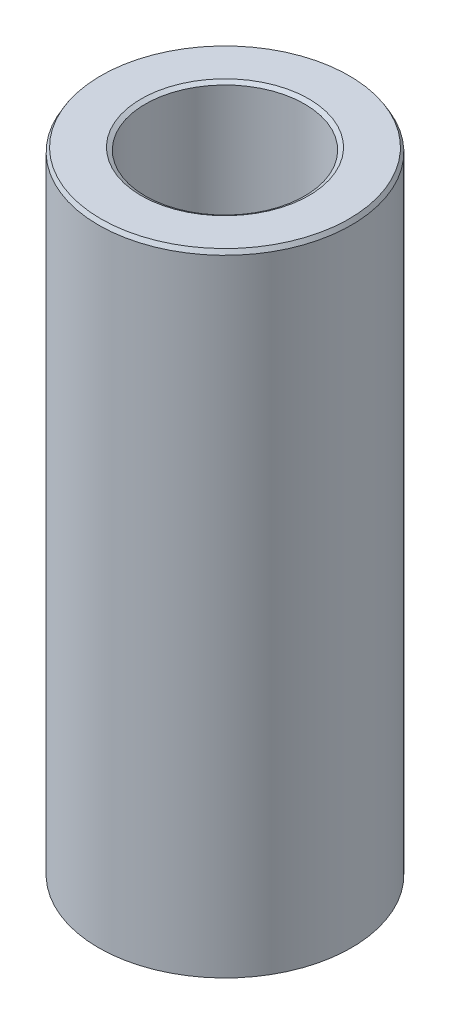
ISO-10303-21;
HEADER;
FILE_DESCRIPTION(('STEP AP214'),'2;1');
FILE_NAME('part.step','',(''),(''),'','','');
FILE_SCHEMA(('AUTOMOTIVE_DESIGN { 1 0 10303 214 1 1 1 1 }'));
ENDSEC;
DATA;
#1=APPLICATION_CONTEXT('core data for automotive mechanical design processes');
#2=APPLICATION_PROTOCOL_DEFINITION('international standard','automotive_design',2000,#1);
#3=PRODUCT_CONTEXT('',#1,'mechanical');
#4=PRODUCT('Part','Part','',(#3));
#5=PRODUCT_RELATED_PRODUCT_CATEGORY('part','',(#4));
#6=PRODUCT_DEFINITION_FORMATION('','',#4);
#7=PRODUCT_DEFINITION_CONTEXT('part definition',#1,'design');
#8=PRODUCT_DEFINITION('design','',#6,#7);
#9=PRODUCT_DEFINITION_SHAPE('','',#8);
#10=(LENGTH_UNIT() NAMED_UNIT(*) SI_UNIT(.MILLI.,.METRE.));
#11=(NAMED_UNIT(*) PLANE_ANGLE_UNIT() SI_UNIT($,.RADIAN.));
#12=(NAMED_UNIT(*) SI_UNIT($,.STERADIAN.) SOLID_ANGLE_UNIT());
#13=UNCERTAINTY_MEASURE_WITH_UNIT(LENGTH_MEASURE(1.E-05),#10,'distance_accuracy_value','');
#14=(GEOMETRIC_REPRESENTATION_CONTEXT(3) GLOBAL_UNCERTAINTY_ASSIGNED_CONTEXT((#13)) GLOBAL_UNIT_ASSIGNED_CONTEXT((#10,
#11,#12)) REPRESENTATION_CONTEXT('',''));
#15=CARTESIAN_POINT('',(0.,0.,0.));
#16=DIRECTION('',(0.,0.,1.));
#17=DIRECTION('',(1.,0.,0.));
#18=AXIS2_PLACEMENT_3D('',#15,#16,#17);
#19=CARTESIAN_POINT('',(0.,137.492743221976,0.));
#20=DIRECTION('',(0.,-1.,0.));
#21=DIRECTION('',(0.,0.,-1.));
#22=AXIS2_PLACEMENT_3D('',#19,#20,#21);
#23=CYLINDRICAL_SURFACE('',#22,27.5);
#24=CARTESIAN_POINT('',(0.,0.522147581139915,0.));
#25=DIRECTION('',(0.,1.,0.));
#26=DIRECTION('',(0.,0.,1.));
#27=AXIS2_PLACEMENT_3D('',#24,#25,#26);
#28=CIRCLE('',#27,27.5);
#29=CARTESIAN_POINT('',(0.,0.522147581139915,27.5));
#30=VERTEX_POINT('',#29);
#31=EDGE_CURVE('E10',#30,#30,#28,.T.);
#32=ORIENTED_EDGE('',*,*,#31,.T.);
#33=EDGE_LOOP('',(#32));
#34=FACE_BOUND('',#33,.T.);
#35=CARTESIAN_POINT('',(0.,136.588357082393,0.));
#36=DIRECTION('',(0.,1.,0.));
#37=DIRECTION('',(0.,0.,1.));
#38=AXIS2_PLACEMENT_3D('',#35,#36,#37);
#39=CIRCLE('',#38,27.5);
#40=CARTESIAN_POINT('',(0.,136.588357082393,27.5));
#41=VERTEX_POINT('',#40);
#42=EDGE_CURVE('E50',#41,#41,#39,.F.);
#43=ORIENTED_EDGE('',*,*,#42,.T.);
#44=EDGE_LOOP('',(#43));
#45=FACE_BOUND('',#44,.T.);
#46=ADVANCED_FACE('F39',(#34,#45),#23,.T.);
#47=CARTESIAN_POINT('',(0.,137.492743221976,0.));
#48=DIRECTION('',(0.,1.,0.));
#49=DIRECTION('',(0.,0.,1.));
#50=AXIS2_PLACEMENT_3D('',#47,#48,#49);
#51=PLANE('',#50);
#52=CARTESIAN_POINT('',(0.,137.492743221976,0.));
#53=DIRECTION('',(0.,1.,0.));
#54=DIRECTION('',(0.,0.,1.));
#55=AXIS2_PLACEMENT_3D('',#52,#53,#54);
#56=CIRCLE('',#55,18.2297252548286);
#57=CARTESIAN_POINT('',(0.,137.492743221976,18.2297252548286));
#58=VERTEX_POINT('',#57);
#59=EDGE_CURVE('E58',#58,#58,#56,.F.);
#60=ORIENTED_EDGE('',*,*,#59,.T.);
#61=EDGE_LOOP('',(#60));
#62=FACE_BOUND('',#61,.T.);
#63=CARTESIAN_POINT('',(0.,137.492743221976,0.));
#64=DIRECTION('',(0.,1.,0.));
#65=DIRECTION('',(0.,0.,1.));
#66=AXIS2_PLACEMENT_3D('',#63,#64,#65);
#67=CIRCLE('',#66,26.9778524188601);
#68=CARTESIAN_POINT('',(0.,137.492743221976,26.9778524188601));
#69=VERTEX_POINT('',#68);
#70=EDGE_CURVE('E61',#69,#69,#67,.T.);
#71=ORIENTED_EDGE('',*,*,#70,.T.);
#72=EDGE_LOOP('',(#71));
#73=FACE_BOUND('',#72,.T.);
#74=ADVANCED_FACE('F88',(#62,#73),#51,.T.);
#75=CARTESIAN_POINT('',(0.,0.,0.));
#76=DIRECTION('',(0.,1.,0.));
#77=DIRECTION('',(0.,0.,1.));
#78=AXIS2_PLACEMENT_3D('',#75,#76,#77);
#79=PLANE('',#78);
#80=CARTESIAN_POINT('',(0.,0.,0.));
#81=DIRECTION('',(0.,1.,0.));
#82=DIRECTION('',(0.,0.,1.));
#83=AXIS2_PLACEMENT_3D('',#80,#81,#82);
#84=CIRCLE('',#83,17.847486696385);
#85=CARTESIAN_POINT('',(0.,0.,-17.847486696385));
#86=VERTEX_POINT('',#85);
#87=EDGE_CURVE('E51',#86,#86,#84,.T.);
#88=ORIENTED_EDGE('',*,*,#87,.T.);
#89=EDGE_LOOP('',(#88));
#90=FACE_BOUND('',#89,.T.);
#91=CARTESIAN_POINT('',(0.,0.,0.));
#92=DIRECTION('',(0.,1.,0.));
#93=DIRECTION('',(0.,0.,1.));
#94=AXIS2_PLACEMENT_3D('',#91,#92,#93);
#95=CIRCLE('',#94,26.5956138604165);
#96=CARTESIAN_POINT('',(0.,0.,26.5956138604165));
#97=VERTEX_POINT('',#96);
#98=EDGE_CURVE('E54',#97,#97,#95,.F.);
#99=ORIENTED_EDGE('',*,*,#98,.T.);
#100=EDGE_LOOP('',(#99));
#101=FACE_BOUND('',#100,.T.);
#102=ADVANCED_FACE('F83',(#90,#101),#79,.F.);
#103=CARTESIAN_POINT('',(0.,137.492743221976,0.));
#104=DIRECTION('',(0.,-1.,0.));
#105=DIRECTION('',(0.,0.,-1.));
#106=AXIS2_PLACEMENT_3D('',#103,#104,#105);
#107=CYLINDRICAL_SURFACE('',#106,17.3253391152451);
#108=CARTESIAN_POINT('',(0.,136.970595640836,0.));
#109=DIRECTION('',(0.,1.,0.));
#110=DIRECTION('',(0.,0.,1.));
#111=AXIS2_PLACEMENT_3D('',#108,#109,#110);
#112=CIRCLE('',#111,17.3253391152451);
#113=CARTESIAN_POINT('',(0.,136.970595640836,17.3253391152451));
#114=VERTEX_POINT('',#113);
#115=EDGE_CURVE('E67',#114,#114,#112,.T.);
#116=ORIENTED_EDGE('',*,*,#115,.T.);
#117=EDGE_LOOP('',(#116));
#118=FACE_BOUND('',#117,.T.);
#119=CARTESIAN_POINT('',(0.,0.904386139583518,0.));
#120=DIRECTION('',(0.,1.,0.));
#121=DIRECTION('',(0.,0.,1.));
#122=AXIS2_PLACEMENT_3D('',#119,#120,#121);
#123=CIRCLE('',#122,17.3253391152451);
#124=CARTESIAN_POINT('',(0.,0.904386139583518,-17.3253391152451));
#125=VERTEX_POINT('',#124);
#126=EDGE_CURVE('E69',#125,#125,#123,.F.);
#127=ORIENTED_EDGE('',*,*,#126,.T.);
#128=EDGE_LOOP('',(#127));
#129=FACE_BOUND('',#128,.T.);
#130=ADVANCED_FACE('F71',(#118,#129),#107,.F.);
#131=CARTESIAN_POINT('',(0.,136.970595640836,0.));
#132=DIRECTION('',(0.,1.,0.));
#133=DIRECTION('',(0.,0.,1.));
#134=AXIS2_PLACEMENT_3D('',#131,#132,#133);
#135=CONICAL_SURFACE('',#134,17.3253391152451,1.04719755119658);
#136=ORIENTED_EDGE('',*,*,#59,.F.);
#137=EDGE_LOOP('',(#136));
#138=FACE_BOUND('',#137,.T.);
#139=ORIENTED_EDGE('',*,*,#115,.F.);
#140=EDGE_LOOP('',(#139));
#141=FACE_BOUND('',#140,.T.);
#142=ADVANCED_FACE('F77',(#138,#141),#135,.F.);
#143=CARTESIAN_POINT('',(0.,0.,0.));
#144=DIRECTION('',(0.,-1.,0.));
#145=DIRECTION('',(0.,0.,-1.));
#146=AXIS2_PLACEMENT_3D('',#143,#144,#145);
#147=CONICAL_SURFACE('',#146,17.847486696385,0.523598775598293);
#148=CARTESIAN_POINT('',(0.,0.904386139583518,-17.3253391152451));
#149=CARTESIAN_POINT('',(0.,0.894965450629523,-17.3307781525486));
#150=CARTESIAN_POINT('',(0.,0.885544761675528,-17.3362171898522));
#151=CARTESIAN_POINT('',(0.,0.866703383767538,-17.3470952644592));
#152=CARTESIAN_POINT('',(0.,0.857282694813543,-17.3525343017628));
#153=CARTESIAN_POINT('',(0.,0.838441316905553,-17.3634123763699));
#154=CARTESIAN_POINT('',(0.,0.829020627951558,-17.3688514136734));
#155=CARTESIAN_POINT('',(0.,0.810179250043568,-17.3797294882805));
#156=CARTESIAN_POINT('',(0.,0.800758561089574,-17.385168525584));
#157=CARTESIAN_POINT('',(0.,0.781917183181584,-17.3960466001911));
#158=CARTESIAN_POINT('',(0.,0.772496494227589,-17.4014856374947));
#159=CARTESIAN_POINT('',(0.,0.753655116319598,-17.4123637121017));
#160=CARTESIAN_POINT('',(0.,0.744234427365604,-17.4178027494053));
#161=CARTESIAN_POINT('',(0.,0.725393049457614,-17.4286808240124));
#162=CARTESIAN_POINT('',(0.,0.715972360503619,-17.4341198613159));
#163=CARTESIAN_POINT('',(0.,0.697130982595629,-17.444997935923));
#164=CARTESIAN_POINT('',(0.,0.687710293641634,-17.4504369732265));
#165=CARTESIAN_POINT('',(0.,0.668868915733644,-17.4613150478336));
#166=CARTESIAN_POINT('',(0.,0.659448226779648,-17.4667540851371));
#167=CARTESIAN_POINT('',(0.,0.640606848871659,-17.4776321597442));
#168=CARTESIAN_POINT('',(0.,0.631186159917664,-17.4830711970478));
#169=CARTESIAN_POINT('',(0.,0.612344782009674,-17.4939492716548));
#170=CARTESIAN_POINT('',(0.,0.602924093055679,-17.4993883089584));
#171=CARTESIAN_POINT('',(0.,0.584082715147689,-17.5102663835655));
#172=CARTESIAN_POINT('',(0.,0.574662026193694,-17.515705420869));
#173=CARTESIAN_POINT('',(0.,0.555820648285704,-17.5265834954761));
#174=CARTESIAN_POINT('',(0.,0.546399959331709,-17.5320225327796));
#175=CARTESIAN_POINT('',(0.,0.527558581423719,-17.5429006073867));
#176=CARTESIAN_POINT('',(0.,0.518137892469724,-17.5483396446902));
#177=CARTESIAN_POINT('',(0.,0.499296514561734,-17.5592177192973));
#178=CARTESIAN_POINT('',(0.,0.489875825607739,-17.5646567566009));
#179=CARTESIAN_POINT('',(0.,0.471034447699749,-17.575534831208));
#180=CARTESIAN_POINT('',(0.,0.461613758745754,-17.5809738685115));
#181=CARTESIAN_POINT('',(0.,0.442772380837764,-17.5918519431186));
#182=CARTESIAN_POINT('',(0.,0.433351691883769,-17.5972909804221));
#183=CARTESIAN_POINT('',(0.,0.414510313975779,-17.6081690550292));
#184=CARTESIAN_POINT('',(0.,0.405089625021784,-17.6136080923327));
#185=CARTESIAN_POINT('',(0.,0.386248247113794,-17.6244861669398));
#186=CARTESIAN_POINT('',(0.,0.376827558159799,-17.6299252042434));
#187=CARTESIAN_POINT('',(0.,0.357986180251809,-17.6408032788504));
#188=CARTESIAN_POINT('',(0.,0.348565491297814,-17.646242316154));
#189=CARTESIAN_POINT('',(0.,0.329724113389824,-17.6571203907611));
#190=CARTESIAN_POINT('',(0.,0.320303424435829,-17.6625594280646));
#191=CARTESIAN_POINT('',(0.,0.301462046527839,-17.6734375026717));
#192=CARTESIAN_POINT('',(0.,0.292041357573844,-17.6788765399752));
#193=CARTESIAN_POINT('',(0.,0.273199979665854,-17.6897546145823));
#194=CARTESIAN_POINT('',(0.,0.26377929071186,-17.6951936518858));
#195=CARTESIAN_POINT('',(0.,0.24493791280387,-17.7060717264929));
#196=CARTESIAN_POINT('',(0.,0.235517223849875,-17.7115107637965));
#197=CARTESIAN_POINT('',(0.,0.216675845941885,-17.7223888384036));
#198=CARTESIAN_POINT('',(0.,0.20725515698789,-17.7278278757071));
#199=CARTESIAN_POINT('',(0.,0.1884137790799,-17.7387059503142));
#200=CARTESIAN_POINT('',(0.,0.178993090125905,-17.7441449876177));
#201=CARTESIAN_POINT('',(0.,0.160151712217915,-17.7550230622248));
#202=CARTESIAN_POINT('',(0.,0.15073102326392,-17.7604620995283));
#203=CARTESIAN_POINT('',(0.,0.13188964535593,-17.7713401741354));
#204=CARTESIAN_POINT('',(0.,0.122468956401934,-17.776779211439));
#205=CARTESIAN_POINT('',(0.,0.103627578493945,-17.787657286046));
#206=CARTESIAN_POINT('',(0.,0.09420688953995,-17.7930963233496));
#207=CARTESIAN_POINT('',(0.,0.0753655116319602,-17.8039743979567));
#208=CARTESIAN_POINT('',(0.,0.065944822677965,-17.8094134352602));
#209=CARTESIAN_POINT('',(0.,0.0471034447699748,-17.8202915098673));
#210=CARTESIAN_POINT('',(0.,0.0376827558159799,-17.8257305471708));
#211=CARTESIAN_POINT('',(0.,0.01884137790799,-17.8366086217779));
#212=CARTESIAN_POINT('',(0.,0.00942068895399509,-17.8420476590814));
#213=CARTESIAN_POINT('',(0.,0.,-17.847486696385));
#214=B_SPLINE_CURVE_WITH_KNOTS('',3,(#148,#149,#150,#151,#152,#153,#154,#155,#156,#157,#158,
#159,#160,#161,#162,#163,#164,#165,#166,#167,#168,#169,#170,#171,#172,#173,#174,#175,#176,#177,
#178,#179,#180,#181,#182,#183,#184,#185,#186,#187,#188,#189,#190,#191,#192,#193,#194,#195,#196,
#197,#198,#199,#200,#201,#202,#203,#204,#205,#206,#207,#208,#209,#210,#211,#212,#213),
.UNSPECIFIED.,.F.,.F.,(4,2,2,2,2,2,2,2,2,2,2,2,2,2,2,2,2,2,2,2,2,2,2,2,2,2,2,2,2,2,2,2,4),(0.,
0.0326342238212441,0.0652684476424881,0.0979026714637322,0.130536895284978,0.163171119106222,
0.195805342927466,0.22843956674871,0.261073790569954,0.293708014391198,0.326342238212444,
0.358976462033688,0.391610685854932,0.424244909676176,0.45687913349742,0.489513357318664,
0.52214758113991,0.554781804961154,0.587416028782398,0.620050252603642,0.652684476424886,
0.68531870024613,0.717952924067374,0.75058714788862,0.783221371709864,0.815855595531108,
0.848489819352352,0.881124043173596,0.91375826699484,0.946392490816086,0.97902671463733,
1.01166093845857,1.04429516227982),.UNSPECIFIED.);
#215=EDGE_CURVE('BSEAM73',#125,#86,#214,.T.);
#216=ORIENTED_EDGE('',*,*,#126,.F.);
#217=ORIENTED_EDGE('',*,*,#87,.F.);
#218=ORIENTED_EDGE('',*,*,#215,.T.);
#219=ORIENTED_EDGE('',*,*,#215,.F.);
#220=EDGE_LOOP('',(#216,#218,#217,#219));
#221=FACE_BOUND('',#220,.T.);
#222=ADVANCED_FACE('F73',(#221),#147,.F.);
#223=CARTESIAN_POINT('',(0.,0.522147581139915,0.));
#224=DIRECTION('',(0.,1.,0.));
#225=DIRECTION('',(0.,0.,1.));
#226=AXIS2_PLACEMENT_3D('',#223,#224,#225);
#227=CONICAL_SURFACE('',#226,27.5,1.04719755119659);
#228=ORIENTED_EDGE('',*,*,#98,.F.);
#229=EDGE_LOOP('',(#228));
#230=FACE_BOUND('',#229,.T.);
#231=ORIENTED_EDGE('',*,*,#31,.F.);
#232=EDGE_LOOP('',(#231));
#233=FACE_BOUND('',#232,.T.);
#234=ADVANCED_FACE('F76',(#230,#233),#227,.T.);
#235=CARTESIAN_POINT('',(0.,137.492743221976,0.));
#236=DIRECTION('',(0.,-1.,0.));
#237=DIRECTION('',(0.,0.,-1.));
#238=AXIS2_PLACEMENT_3D('',#235,#236,#237);
#239=CONICAL_SURFACE('',#238,26.9778524188601,0.523598775598295);
#240=ORIENTED_EDGE('',*,*,#42,.F.);
#241=EDGE_LOOP('',(#240));
#242=FACE_BOUND('',#241,.T.);
#243=ORIENTED_EDGE('',*,*,#70,.F.);
#244=EDGE_LOOP('',(#243));
#245=FACE_BOUND('',#244,.T.);
#246=ADVANCED_FACE('F45',(#242,#245),#239,.T.);
#247=CLOSED_SHELL('',(#46,#74,#102,#130,#142,#222,#234,#246));
#248=MANIFOLD_SOLID_BREP('B2',#247);
#249=ADVANCED_BREP_SHAPE_REPRESENTATION('',(#18,#248),#14);
#250=SHAPE_DEFINITION_REPRESENTATION(#9,#249);
ENDSEC;
END-ISO-10303-21;
